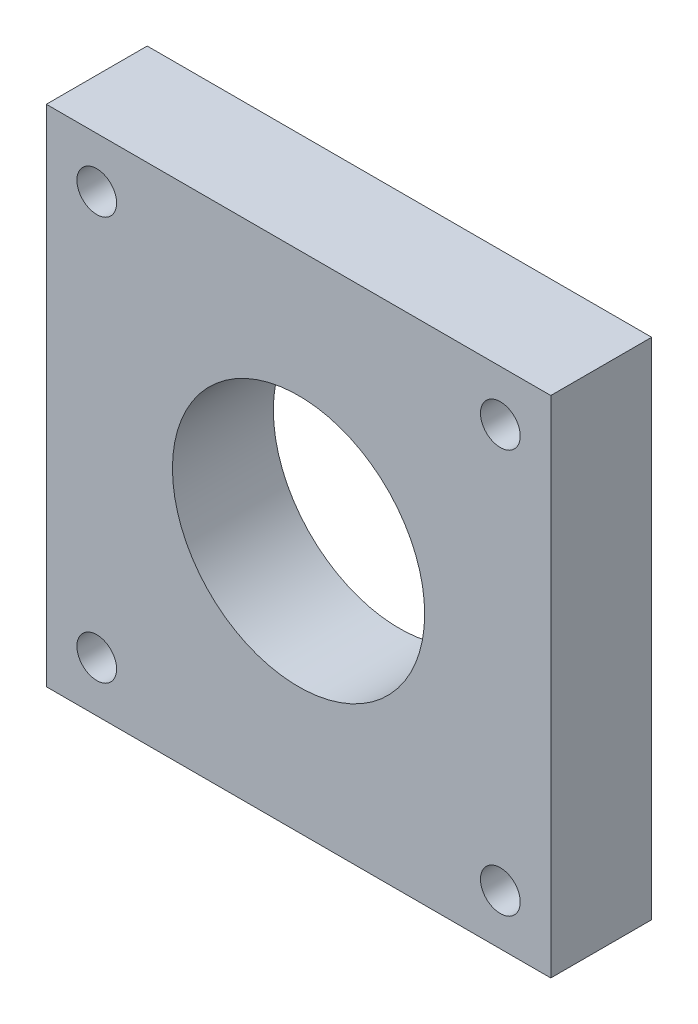
ISO-10303-21;
HEADER;
FILE_DESCRIPTION(('STEP AP214'),'2;1');
FILE_NAME('part.step','',(''),(''),'','','');
FILE_SCHEMA(('AUTOMOTIVE_DESIGN { 1 0 10303 214 1 1 1 1 }'));
ENDSEC;
DATA;
#1=APPLICATION_CONTEXT('core data for automotive mechanical design processes');
#2=APPLICATION_PROTOCOL_DEFINITION('international standard','automotive_design',2000,#1);
#3=PRODUCT_CONTEXT('',#1,'mechanical');
#4=PRODUCT('Part','Part','',(#3));
#5=PRODUCT_RELATED_PRODUCT_CATEGORY('part','',(#4));
#6=PRODUCT_DEFINITION_FORMATION('','',#4);
#7=PRODUCT_DEFINITION_CONTEXT('part definition',#1,'design');
#8=PRODUCT_DEFINITION('design','',#6,#7);
#9=PRODUCT_DEFINITION_SHAPE('','',#8);
#10=(LENGTH_UNIT() NAMED_UNIT(*) SI_UNIT(.MILLI.,.METRE.));
#11=(NAMED_UNIT(*) PLANE_ANGLE_UNIT() SI_UNIT($,.RADIAN.));
#12=(NAMED_UNIT(*) SI_UNIT($,.STERADIAN.) SOLID_ANGLE_UNIT());
#13=UNCERTAINTY_MEASURE_WITH_UNIT(LENGTH_MEASURE(1.E-05),#10,'distance_accuracy_value','');
#14=(GEOMETRIC_REPRESENTATION_CONTEXT(3) GLOBAL_UNCERTAINTY_ASSIGNED_CONTEXT((#13)) GLOBAL_UNIT_ASSIGNED_CONTEXT((#10,
#11,#12)) REPRESENTATION_CONTEXT('',''));
#15=CARTESIAN_POINT('',(0.,0.,0.));
#16=DIRECTION('',(0.,0.,1.));
#17=DIRECTION('',(1.,0.,0.));
#18=AXIS2_PLACEMENT_3D('',#15,#16,#17);
#19=CARTESIAN_POINT('',(25.4,-25.4,10.16));
#20=DIRECTION('',(0.,0.,1.));
#21=DIRECTION('',(1.,0.,0.));
#22=AXIS2_PLACEMENT_3D('',#19,#20,#21);
#23=PLANE('',#22);
#24=CARTESIAN_POINT('',(-20.32,-20.32,10.16));
#25=DIRECTION('',(0.,0.,1.));
#26=DIRECTION('',(1.,0.,0.));
#27=AXIS2_PLACEMENT_3D('',#24,#25,#26);
#28=CIRCLE('',#27,2.);
#29=CARTESIAN_POINT('',(-18.32,-20.32,10.16));
#30=VERTEX_POINT('',#29);
#31=EDGE_CURVE('E125',#30,#30,#28,.T.);
#32=ORIENTED_EDGE('',*,*,#31,.F.);
#33=EDGE_LOOP('',(#32));
#34=FACE_BOUND('',#33,.T.);
#35=CARTESIAN_POINT('',(20.32,20.32,10.16));
#36=DIRECTION('',(0.,0.,1.));
#37=DIRECTION('',(1.,0.,0.));
#38=AXIS2_PLACEMENT_3D('',#35,#36,#37);
#39=CIRCLE('',#38,2.);
#40=CARTESIAN_POINT('',(22.32,20.32,10.16));
#41=VERTEX_POINT('',#40);
#42=EDGE_CURVE('E113',#41,#41,#39,.T.);
#43=ORIENTED_EDGE('',*,*,#42,.F.);
#44=EDGE_LOOP('',(#43));
#45=FACE_BOUND('',#44,.T.);
#46=DIRECTION('',(0.,1.,0.));
#47=VECTOR('',#46,1.);
#48=CARTESIAN_POINT('',(25.4,25.4,10.16));
#49=LINE('',#48,#47);
#50=CARTESIAN_POINT('',(25.4,-25.4,10.16));
#51=VERTEX_POINT('',#50);
#52=CARTESIAN_POINT('',(25.4,25.4,10.16));
#53=VERTEX_POINT('',#52);
#54=EDGE_CURVE('E83',#51,#53,#49,.T.);
#55=ORIENTED_EDGE('',*,*,#54,.T.);
#56=DIRECTION('',(-1.,0.,0.));
#57=VECTOR('',#56,1.);
#58=CARTESIAN_POINT('',(-25.4,25.4,10.16));
#59=LINE('',#58,#57);
#60=CARTESIAN_POINT('',(-25.4,25.4,10.16));
#61=VERTEX_POINT('',#60);
#62=EDGE_CURVE('E78',#53,#61,#59,.T.);
#63=ORIENTED_EDGE('',*,*,#62,.T.);
#64=DIRECTION('',(0.,-1.,0.));
#65=VECTOR('',#64,1.);
#66=CARTESIAN_POINT('',(-25.4,25.4,10.16));
#67=LINE('',#66,#65);
#68=CARTESIAN_POINT('',(-25.4,-25.4,10.16));
#69=VERTEX_POINT('',#68);
#70=EDGE_CURVE('E81',#61,#69,#67,.T.);
#71=ORIENTED_EDGE('',*,*,#70,.T.);
#72=DIRECTION('',(1.,0.,0.));
#73=VECTOR('',#72,1.);
#74=CARTESIAN_POINT('',(-25.4,-25.4,10.16));
#75=LINE('',#74,#73);
#76=EDGE_CURVE('E48',#69,#51,#75,.T.);
#77=ORIENTED_EDGE('',*,*,#76,.T.);
#78=EDGE_LOOP('',(#55,#63,#71,#77));
#79=FACE_BOUND('',#78,.T.);
#80=CARTESIAN_POINT('',(-20.32,20.32,10.16));
#81=DIRECTION('',(0.,0.,1.));
#82=DIRECTION('',(1.,0.,0.));
#83=AXIS2_PLACEMENT_3D('',#80,#81,#82);
#84=CIRCLE('',#83,2.);
#85=CARTESIAN_POINT('',(-18.32,20.32,10.16));
#86=VERTEX_POINT('',#85);
#87=EDGE_CURVE('E98',#86,#86,#84,.T.);
#88=ORIENTED_EDGE('',*,*,#87,.F.);
#89=EDGE_LOOP('',(#88));
#90=FACE_BOUND('',#89,.T.);
#91=CARTESIAN_POINT('',(20.32,-20.32,10.16));
#92=DIRECTION('',(0.,0.,1.));
#93=DIRECTION('',(1.,0.,0.));
#94=AXIS2_PLACEMENT_3D('',#91,#92,#93);
#95=CIRCLE('',#94,2.);
#96=CARTESIAN_POINT('',(22.32,-20.32,10.16));
#97=VERTEX_POINT('',#96);
#98=EDGE_CURVE('E119',#97,#97,#95,.T.);
#99=ORIENTED_EDGE('',*,*,#98,.F.);
#100=EDGE_LOOP('',(#99));
#101=FACE_BOUND('',#100,.T.);
#102=CARTESIAN_POINT('',(0.,0.,10.16));
#103=DIRECTION('',(0.,0.,1.));
#104=DIRECTION('',(1.,0.,0.));
#105=AXIS2_PLACEMENT_3D('',#102,#103,#104);
#106=CIRCLE('',#105,12.7);
#107=CARTESIAN_POINT('',(12.7,0.,10.16));
#108=VERTEX_POINT('',#107);
#109=EDGE_CURVE('E131',#108,#108,#106,.T.);
#110=ORIENTED_EDGE('',*,*,#109,.F.);
#111=EDGE_LOOP('',(#110));
#112=FACE_BOUND('',#111,.T.);
#113=ADVANCED_FACE('F31',(#34,#45,#79,#90,#101,#112),#23,.T.);
#114=CARTESIAN_POINT('',(25.4,-25.4,0.));
#115=DIRECTION('',(0.,0.,1.));
#116=DIRECTION('',(1.,0.,0.));
#117=AXIS2_PLACEMENT_3D('',#114,#115,#116);
#118=PLANE('',#117);
#119=CARTESIAN_POINT('',(-20.32,-20.32,0.));
#120=DIRECTION('',(0.,0.,1.));
#121=DIRECTION('',(1.,0.,0.));
#122=AXIS2_PLACEMENT_3D('',#119,#120,#121);
#123=CIRCLE('',#122,2.);
#124=CARTESIAN_POINT('',(-18.32,-20.32,0.));
#125=VERTEX_POINT('',#124);
#126=EDGE_CURVE('E128',#125,#125,#123,.T.);
#127=ORIENTED_EDGE('',*,*,#126,.T.);
#128=EDGE_LOOP('',(#127));
#129=FACE_BOUND('',#128,.T.);
#130=CARTESIAN_POINT('',(20.32,20.32,0.));
#131=DIRECTION('',(0.,0.,1.));
#132=DIRECTION('',(1.,0.,0.));
#133=AXIS2_PLACEMENT_3D('',#130,#131,#132);
#134=CIRCLE('',#133,2.);
#135=CARTESIAN_POINT('',(22.32,20.32,0.));
#136=VERTEX_POINT('',#135);
#137=EDGE_CURVE('E116',#136,#136,#134,.T.);
#138=ORIENTED_EDGE('',*,*,#137,.T.);
#139=EDGE_LOOP('',(#138));
#140=FACE_BOUND('',#139,.T.);
#141=DIRECTION('',(0.,1.,0.));
#142=VECTOR('',#141,1.);
#143=CARTESIAN_POINT('',(25.4,25.4,0.));
#144=LINE('',#143,#142);
#145=CARTESIAN_POINT('',(25.4,-25.4,0.));
#146=VERTEX_POINT('',#145);
#147=CARTESIAN_POINT('',(25.4,25.4,0.));
#148=VERTEX_POINT('',#147);
#149=EDGE_CURVE('E95',#146,#148,#144,.T.);
#150=ORIENTED_EDGE('',*,*,#149,.F.);
#151=DIRECTION('',(1.,0.,0.));
#152=VECTOR('',#151,1.);
#153=CARTESIAN_POINT('',(-25.4,-25.4,0.));
#154=LINE('',#153,#152);
#155=CARTESIAN_POINT('',(-25.4,-25.4,0.));
#156=VERTEX_POINT('',#155);
#157=EDGE_CURVE('E71',#156,#146,#154,.T.);
#158=ORIENTED_EDGE('',*,*,#157,.F.);
#159=DIRECTION('',(0.,-1.,0.));
#160=VECTOR('',#159,1.);
#161=CARTESIAN_POINT('',(-25.4,25.4,0.));
#162=LINE('',#161,#160);
#163=CARTESIAN_POINT('',(-25.4,25.4,0.));
#164=VERTEX_POINT('',#163);
#165=EDGE_CURVE('E65',#164,#156,#162,.T.);
#166=ORIENTED_EDGE('',*,*,#165,.F.);
#167=DIRECTION('',(-1.,0.,0.));
#168=VECTOR('',#167,1.);
#169=CARTESIAN_POINT('',(-25.4,25.4,0.));
#170=LINE('',#169,#168);
#171=EDGE_CURVE('E87',#148,#164,#170,.T.);
#172=ORIENTED_EDGE('',*,*,#171,.F.);
#173=EDGE_LOOP('',(#150,#158,#166,#172));
#174=FACE_BOUND('',#173,.T.);
#175=CARTESIAN_POINT('',(-20.32,20.32,0.));
#176=DIRECTION('',(0.,0.,1.));
#177=DIRECTION('',(1.,0.,0.));
#178=AXIS2_PLACEMENT_3D('',#175,#176,#177);
#179=CIRCLE('',#178,2.);
#180=CARTESIAN_POINT('',(-18.32,20.32,0.));
#181=VERTEX_POINT('',#180);
#182=EDGE_CURVE('E110',#181,#181,#179,.T.);
#183=ORIENTED_EDGE('',*,*,#182,.T.);
#184=EDGE_LOOP('',(#183));
#185=FACE_BOUND('',#184,.T.);
#186=CARTESIAN_POINT('',(20.32,-20.32,0.));
#187=DIRECTION('',(0.,0.,1.));
#188=DIRECTION('',(1.,0.,0.));
#189=AXIS2_PLACEMENT_3D('',#186,#187,#188);
#190=CIRCLE('',#189,2.);
#191=CARTESIAN_POINT('',(22.32,-20.32,0.));
#192=VERTEX_POINT('',#191);
#193=EDGE_CURVE('E122',#192,#192,#190,.T.);
#194=ORIENTED_EDGE('',*,*,#193,.T.);
#195=EDGE_LOOP('',(#194));
#196=FACE_BOUND('',#195,.T.);
#197=CARTESIAN_POINT('',(0.,0.,0.));
#198=DIRECTION('',(0.,0.,1.));
#199=DIRECTION('',(1.,0.,0.));
#200=AXIS2_PLACEMENT_3D('',#197,#198,#199);
#201=CIRCLE('',#200,12.7);
#202=CARTESIAN_POINT('',(12.7,0.,0.));
#203=VERTEX_POINT('',#202);
#204=EDGE_CURVE('E134',#203,#203,#201,.T.);
#205=ORIENTED_EDGE('',*,*,#204,.T.);
#206=EDGE_LOOP('',(#205));
#207=FACE_BOUND('',#206,.T.);
#208=ADVANCED_FACE('F106',(#129,#140,#174,#185,#196,#207),#118,.F.);
#209=CARTESIAN_POINT('',(25.4,25.4,10.16));
#210=DIRECTION('',(-1.,0.,0.));
#211=DIRECTION('',(0.,-1.,0.));
#212=AXIS2_PLACEMENT_3D('',#209,#210,#211);
#213=PLANE('',#212);
#214=ORIENTED_EDGE('',*,*,#149,.T.);
#215=DIRECTION('',(0.,0.,-1.));
#216=VECTOR('',#215,1.);
#217=CARTESIAN_POINT('',(25.4,25.4,10.16));
#218=LINE('',#217,#216);
#219=EDGE_CURVE('E11',#53,#148,#218,.T.);
#220=ORIENTED_EDGE('',*,*,#219,.F.);
#221=ORIENTED_EDGE('',*,*,#54,.F.);
#222=DIRECTION('',(0.,0.,-1.));
#223=VECTOR('',#222,1.);
#224=CARTESIAN_POINT('',(25.4,-25.4,10.16));
#225=LINE('',#224,#223);
#226=EDGE_CURVE('E91',#51,#146,#225,.T.);
#227=ORIENTED_EDGE('',*,*,#226,.T.);
#228=EDGE_LOOP('',(#214,#220,#221,#227));
#229=FACE_BOUND('',#228,.T.);
#230=ADVANCED_FACE('F33',(#229),#213,.F.);
#231=CARTESIAN_POINT('',(-25.4,25.4,10.16));
#232=DIRECTION('',(0.,-1.,0.));
#233=DIRECTION('',(0.,0.,-1.));
#234=AXIS2_PLACEMENT_3D('',#231,#232,#233);
#235=PLANE('',#234);
#236=ORIENTED_EDGE('',*,*,#171,.T.);
#237=DIRECTION('',(0.,0.,-1.));
#238=VECTOR('',#237,1.);
#239=CARTESIAN_POINT('',(-25.4,25.4,10.16));
#240=LINE('',#239,#238);
#241=EDGE_CURVE('E40',#61,#164,#240,.T.);
#242=ORIENTED_EDGE('',*,*,#241,.F.);
#243=ORIENTED_EDGE('',*,*,#62,.F.);
#244=ORIENTED_EDGE('',*,*,#219,.T.);
#245=EDGE_LOOP('',(#236,#242,#243,#244));
#246=FACE_BOUND('',#245,.T.);
#247=ADVANCED_FACE('F86',(#246),#235,.F.);
#248=CARTESIAN_POINT('',(-25.4,25.4,10.16));
#249=DIRECTION('',(1.,0.,0.));
#250=DIRECTION('',(0.,1.,0.));
#251=AXIS2_PLACEMENT_3D('',#248,#249,#250);
#252=PLANE('',#251);
#253=ORIENTED_EDGE('',*,*,#165,.T.);
#254=DIRECTION('',(0.,0.,-1.));
#255=VECTOR('',#254,1.);
#256=CARTESIAN_POINT('',(-25.4,-25.4,10.16));
#257=LINE('',#256,#255);
#258=EDGE_CURVE('E88',#69,#156,#257,.T.);
#259=ORIENTED_EDGE('',*,*,#258,.F.);
#260=ORIENTED_EDGE('',*,*,#70,.F.);
#261=ORIENTED_EDGE('',*,*,#241,.T.);
#262=EDGE_LOOP('',(#253,#259,#260,#261));
#263=FACE_BOUND('',#262,.T.);
#264=ADVANCED_FACE('F89',(#263),#252,.F.);
#265=CARTESIAN_POINT('',(-25.4,-25.4,10.16));
#266=DIRECTION('',(0.,1.,0.));
#267=DIRECTION('',(0.,0.,1.));
#268=AXIS2_PLACEMENT_3D('',#265,#266,#267);
#269=PLANE('',#268);
#270=ORIENTED_EDGE('',*,*,#157,.T.);
#271=ORIENTED_EDGE('',*,*,#226,.F.);
#272=ORIENTED_EDGE('',*,*,#76,.F.);
#273=ORIENTED_EDGE('',*,*,#258,.T.);
#274=EDGE_LOOP('',(#270,#271,#272,#273));
#275=FACE_BOUND('',#274,.T.);
#276=ADVANCED_FACE('F103',(#275),#269,.F.);
#277=CARTESIAN_POINT('',(-20.32,20.32,10.16));
#278=DIRECTION('',(0.,0.,-1.));
#279=DIRECTION('',(-1.,0.,0.));
#280=AXIS2_PLACEMENT_3D('',#277,#278,#279);
#281=CYLINDRICAL_SURFACE('',#280,2.);
#282=ORIENTED_EDGE('',*,*,#87,.T.);
#283=EDGE_LOOP('',(#282));
#284=FACE_BOUND('',#283,.T.);
#285=ORIENTED_EDGE('',*,*,#182,.F.);
#286=EDGE_LOOP('',(#285));
#287=FACE_BOUND('',#286,.T.);
#288=ADVANCED_FACE('F154',(#284,#287),#281,.F.);
#289=CARTESIAN_POINT('',(20.32,20.32,10.16));
#290=DIRECTION('',(0.,0.,-1.));
#291=DIRECTION('',(-1.,0.,0.));
#292=AXIS2_PLACEMENT_3D('',#289,#290,#291);
#293=CYLINDRICAL_SURFACE('',#292,2.);
#294=ORIENTED_EDGE('',*,*,#42,.T.);
#295=EDGE_LOOP('',(#294));
#296=FACE_BOUND('',#295,.T.);
#297=ORIENTED_EDGE('',*,*,#137,.F.);
#298=EDGE_LOOP('',(#297));
#299=FACE_BOUND('',#298,.T.);
#300=ADVANCED_FACE('F200',(#296,#299),#293,.F.);
#301=CARTESIAN_POINT('',(20.32,-20.32,10.16));
#302=DIRECTION('',(0.,0.,-1.));
#303=DIRECTION('',(-1.,0.,0.));
#304=AXIS2_PLACEMENT_3D('',#301,#302,#303);
#305=CYLINDRICAL_SURFACE('',#304,2.);
#306=ORIENTED_EDGE('',*,*,#98,.T.);
#307=EDGE_LOOP('',(#306));
#308=FACE_BOUND('',#307,.T.);
#309=ORIENTED_EDGE('',*,*,#193,.F.);
#310=EDGE_LOOP('',(#309));
#311=FACE_BOUND('',#310,.T.);
#312=ADVANCED_FACE('F208',(#308,#311),#305,.F.);
#313=CARTESIAN_POINT('',(-20.32,-20.32,10.16));
#314=DIRECTION('',(0.,0.,-1.));
#315=DIRECTION('',(-1.,0.,0.));
#316=AXIS2_PLACEMENT_3D('',#313,#314,#315);
#317=CYLINDRICAL_SURFACE('',#316,2.);
#318=ORIENTED_EDGE('',*,*,#31,.T.);
#319=EDGE_LOOP('',(#318));
#320=FACE_BOUND('',#319,.T.);
#321=ORIENTED_EDGE('',*,*,#126,.F.);
#322=EDGE_LOOP('',(#321));
#323=FACE_BOUND('',#322,.T.);
#324=ADVANCED_FACE('F216',(#320,#323),#317,.F.);
#325=CARTESIAN_POINT('',(0.,0.,10.16));
#326=DIRECTION('',(0.,0.,-1.));
#327=DIRECTION('',(-1.,0.,0.));
#328=AXIS2_PLACEMENT_3D('',#325,#326,#327);
#329=CYLINDRICAL_SURFACE('',#328,12.7);
#330=ORIENTED_EDGE('',*,*,#109,.T.);
#331=EDGE_LOOP('',(#330));
#332=FACE_BOUND('',#331,.T.);
#333=ORIENTED_EDGE('',*,*,#204,.F.);
#334=EDGE_LOOP('',(#333));
#335=FACE_BOUND('',#334,.T.);
#336=ADVANCED_FACE('F140',(#332,#335),#329,.F.);
#337=CLOSED_SHELL('',(#113,#208,#230,#247,#264,#276,#288,#300,#312,#324,#336));
#338=MANIFOLD_SOLID_BREP('B2',#337);
#339=ADVANCED_BREP_SHAPE_REPRESENTATION('',(#18,#338),#14);
#340=SHAPE_DEFINITION_REPRESENTATION(#9,#339);
ENDSEC;
END-ISO-10303-21;
